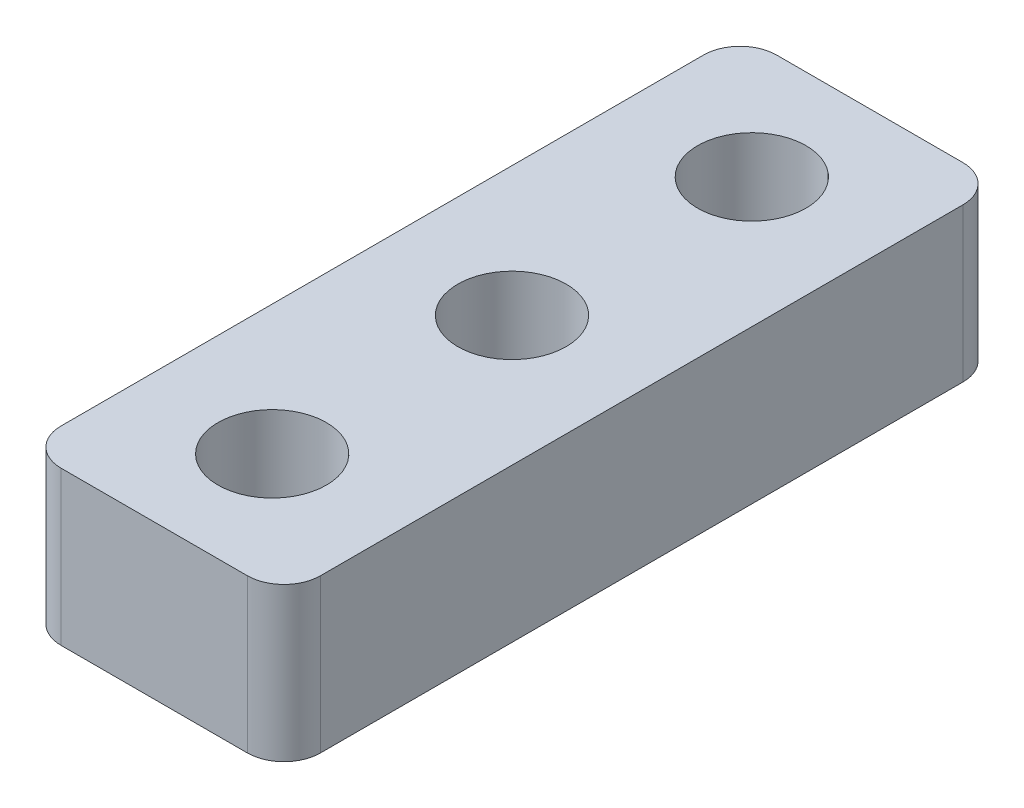
ISO-10303-21;
HEADER;
FILE_DESCRIPTION(('STEP AP214'),'2;1');
FILE_NAME('part.step','',(''),(''),'','','');
FILE_SCHEMA(('AUTOMOTIVE_DESIGN { 1 0 10303 214 1 1 1 1 }'));
ENDSEC;
DATA;
#1=APPLICATION_CONTEXT('core data for automotive mechanical design processes');
#2=APPLICATION_PROTOCOL_DEFINITION('international standard','automotive_design',2000,#1);
#3=PRODUCT_CONTEXT('',#1,'mechanical');
#4=PRODUCT('Part','Part','',(#3));
#5=PRODUCT_RELATED_PRODUCT_CATEGORY('part','',(#4));
#6=PRODUCT_DEFINITION_FORMATION('','',#4);
#7=PRODUCT_DEFINITION_CONTEXT('part definition',#1,'design');
#8=PRODUCT_DEFINITION('design','',#6,#7);
#9=PRODUCT_DEFINITION_SHAPE('','',#8);
#10=(LENGTH_UNIT() NAMED_UNIT(*) SI_UNIT(.MILLI.,.METRE.));
#11=(NAMED_UNIT(*) PLANE_ANGLE_UNIT() SI_UNIT($,.RADIAN.));
#12=(NAMED_UNIT(*) SI_UNIT($,.STERADIAN.) SOLID_ANGLE_UNIT());
#13=UNCERTAINTY_MEASURE_WITH_UNIT(LENGTH_MEASURE(1.E-05),#10,'distance_accuracy_value','');
#14=(GEOMETRIC_REPRESENTATION_CONTEXT(3) GLOBAL_UNCERTAINTY_ASSIGNED_CONTEXT((#13)) GLOBAL_UNIT_ASSIGNED_CONTEXT((#10,
#11,#12)) REPRESENTATION_CONTEXT('',''));
#15=CARTESIAN_POINT('',(0.,0.,0.));
#16=DIRECTION('',(0.,0.,1.));
#17=DIRECTION('',(1.,0.,0.));
#18=AXIS2_PLACEMENT_3D('',#15,#16,#17);
#19=CARTESIAN_POINT('',(0.,3.2004,7.459999939));
#20=DIRECTION('',(0.,-1.,0.));
#21=DIRECTION('',(1.,0.,0.));
#22=AXIS2_PLACEMENT_3D('',#19,#20,#21);
#23=PLANE('',#22);
#24=CARTESIAN_POINT('',(2.7045,3.2004,-4.9999999695));
#25=DIRECTION('',(0.,-1.,0.));
#26=DIRECTION('',(1.,0.,0.));
#27=AXIS2_PLACEMENT_3D('',#24,#25,#26);
#28=CIRCLE('',#27,1.1303);
#29=CARTESIAN_POINT('',(3.8348,3.2004,-4.9999999695));
#30=VERTEX_POINT('',#29);
#31=EDGE_CURVE('E245',#30,#30,#28,.F.);
#32=ORIENTED_EDGE('',*,*,#31,.F.);
#33=EDGE_LOOP('',(#32));
#34=FACE_BOUND('',#33,.T.);
#35=CARTESIAN_POINT('',(2.7045,3.2004,4.9999999695));
#36=DIRECTION('',(0.,-1.,0.));
#37=DIRECTION('',(1.,0.,0.));
#38=AXIS2_PLACEMENT_3D('',#35,#36,#37);
#39=CIRCLE('',#38,1.1303);
#40=CARTESIAN_POINT('',(3.8348,3.2004,4.9999999695));
#41=VERTEX_POINT('',#40);
#42=EDGE_CURVE('E240',#41,#41,#39,.F.);
#43=ORIENTED_EDGE('',*,*,#42,.F.);
#44=EDGE_LOOP('',(#43));
#45=FACE_BOUND('',#44,.T.);
#46=CARTESIAN_POINT('',(2.7045,3.2004,0.));
#47=DIRECTION('',(0.,-1.,0.));
#48=DIRECTION('',(1.,0.,0.));
#49=AXIS2_PLACEMENT_3D('',#46,#47,#48);
#50=CIRCLE('',#49,1.1303);
#51=CARTESIAN_POINT('',(3.8348,3.2004,0.));
#52=VERTEX_POINT('',#51);
#53=EDGE_CURVE('E158',#52,#52,#50,.F.);
#54=ORIENTED_EDGE('',*,*,#53,.F.);
#55=EDGE_LOOP('',(#54));
#56=FACE_BOUND('',#55,.T.);
#57=DIRECTION('',(-1.,0.,0.));
#58=VECTOR('',#57,1.);
#59=CARTESIAN_POINT('',(0.,3.2004,-7.459999939));
#60=LINE('',#59,#58);
#61=CARTESIAN_POINT('',(4.647,3.2004,-7.459999939));
#62=VERTEX_POINT('',#61);
#63=CARTESIAN_POINT('',(0.761999999999999,3.2004,-7.459999939));
#64=VERTEX_POINT('',#63);
#65=EDGE_CURVE('E155',#62,#64,#60,.T.);
#66=ORIENTED_EDGE('',*,*,#65,.T.);
#67=CARTESIAN_POINT('',(0.761999999999999,3.2004,-6.697999939));
#68=DIRECTION('',(0.,-1.,0.));
#69=DIRECTION('',(1.,0.,0.));
#70=AXIS2_PLACEMENT_3D('',#67,#68,#69);
#71=CIRCLE('',#70,0.762);
#72=CARTESIAN_POINT('',(0.,3.2004,-6.697999939));
#73=VERTEX_POINT('',#72);
#74=EDGE_CURVE('E140',#64,#73,#71,.F.);
#75=ORIENTED_EDGE('',*,*,#74,.T.);
#76=DIRECTION('',(0.,0.,-1.));
#77=VECTOR('',#76,1.);
#78=CARTESIAN_POINT('',(0.,3.2004,7.459999939));
#79=LINE('',#78,#77);
#80=CARTESIAN_POINT('',(0.,3.2004,6.697999939));
#81=VERTEX_POINT('',#80);
#82=EDGE_CURVE('E119',#81,#73,#79,.T.);
#83=ORIENTED_EDGE('',*,*,#82,.F.);
#84=CARTESIAN_POINT('',(0.761999999999999,3.2004,6.697999939));
#85=DIRECTION('',(0.,-1.,0.));
#86=DIRECTION('',(1.,0.,0.));
#87=AXIS2_PLACEMENT_3D('',#84,#85,#86);
#88=CIRCLE('',#87,0.762);
#89=CARTESIAN_POINT('',(0.761999999999999,3.2004,7.459999939));
#90=VERTEX_POINT('',#89);
#91=EDGE_CURVE('E123',#81,#90,#88,.F.);
#92=ORIENTED_EDGE('',*,*,#91,.T.);
#93=DIRECTION('',(-1.,0.,0.));
#94=VECTOR('',#93,1.);
#95=CARTESIAN_POINT('',(0.,3.2004,7.459999939));
#96=LINE('',#95,#94);
#97=CARTESIAN_POINT('',(4.647,3.2004,7.459999939));
#98=VERTEX_POINT('',#97);
#99=EDGE_CURVE('E149',#98,#90,#96,.T.);
#100=ORIENTED_EDGE('',*,*,#99,.F.);
#101=CARTESIAN_POINT('',(4.647,3.2004,6.697999939));
#102=DIRECTION('',(0.,-1.,0.));
#103=DIRECTION('',(1.,0.,0.));
#104=AXIS2_PLACEMENT_3D('',#101,#102,#103);
#105=CIRCLE('',#104,0.762);
#106=CARTESIAN_POINT('',(5.409,3.2004,6.697999939));
#107=VERTEX_POINT('',#106);
#108=EDGE_CURVE('E55',#98,#107,#105,.F.);
#109=ORIENTED_EDGE('',*,*,#108,.T.);
#110=DIRECTION('',(0.,0.,-1.));
#111=VECTOR('',#110,1.);
#112=CARTESIAN_POINT('',(5.409,3.2004,7.459999939));
#113=LINE('',#112,#111);
#114=CARTESIAN_POINT('',(5.409,3.2004,-6.697999939));
#115=VERTEX_POINT('',#114);
#116=EDGE_CURVE('E152',#107,#115,#113,.T.);
#117=ORIENTED_EDGE('',*,*,#116,.T.);
#118=CARTESIAN_POINT('',(4.647,3.2004,-6.697999939));
#119=DIRECTION('',(0.,-1.,0.));
#120=DIRECTION('',(1.,0.,0.));
#121=AXIS2_PLACEMENT_3D('',#118,#119,#120);
#122=CIRCLE('',#121,0.762);
#123=EDGE_CURVE('E47',#115,#62,#122,.F.);
#124=ORIENTED_EDGE('',*,*,#123,.T.);
#125=EDGE_LOOP('',(#66,#75,#83,#92,#100,#109,#117,#124));
#126=FACE_BOUND('',#125,.T.);
#127=ADVANCED_FACE('F32',(#34,#45,#56,#126),#23,.F.);
#128=CARTESIAN_POINT('',(0.,0.,7.459999939));
#129=DIRECTION('',(1.,0.,0.));
#130=DIRECTION('',(0.,1.,0.));
#131=AXIS2_PLACEMENT_3D('',#128,#129,#130);
#132=PLANE('',#131);
#133=ORIENTED_EDGE('',*,*,#82,.T.);
#134=DIRECTION('',(0.,-1.,0.));
#135=VECTOR('',#134,1.);
#136=CARTESIAN_POINT('',(0.,0.,-6.697999939));
#137=LINE('',#136,#135);
#138=CARTESIAN_POINT('',(0.,0.,-6.697999939));
#139=VERTEX_POINT('',#138);
#140=EDGE_CURVE('E110',#73,#139,#137,.T.);
#141=ORIENTED_EDGE('',*,*,#140,.T.);
#142=DIRECTION('',(0.,0.,-1.));
#143=VECTOR('',#142,1.);
#144=CARTESIAN_POINT('',(0.,0.,7.459999939));
#145=LINE('',#144,#143);
#146=CARTESIAN_POINT('',(0.,0.,6.697999939));
#147=VERTEX_POINT('',#146);
#148=EDGE_CURVE('E102',#147,#139,#145,.T.);
#149=ORIENTED_EDGE('',*,*,#148,.F.);
#150=DIRECTION('',(0.,-1.,0.));
#151=VECTOR('',#150,1.);
#152=CARTESIAN_POINT('',(0.,0.,6.697999939));
#153=LINE('',#152,#151);
#154=EDGE_CURVE('E116',#147,#81,#153,.F.);
#155=ORIENTED_EDGE('',*,*,#154,.T.);
#156=EDGE_LOOP('',(#133,#141,#149,#155));
#157=FACE_BOUND('',#156,.T.);
#158=ADVANCED_FACE('F115',(#157),#132,.F.);
#159=CARTESIAN_POINT('',(0.,0.,7.459999939));
#160=DIRECTION('',(0.,1.,0.));
#161=DIRECTION('',(-1.,0.,0.));
#162=AXIS2_PLACEMENT_3D('',#159,#160,#161);
#163=PLANE('',#162);
#164=CARTESIAN_POINT('',(2.7045,0.,-4.9999999695));
#165=DIRECTION('',(0.,-1.,0.));
#166=DIRECTION('',(1.,0.,0.));
#167=AXIS2_PLACEMENT_3D('',#164,#165,#166);
#168=CIRCLE('',#167,1.1303);
#169=CARTESIAN_POINT('',(3.8348,0.,-4.9999999695));
#170=VERTEX_POINT('',#169);
#171=EDGE_CURVE('E231',#170,#170,#168,.T.);
#172=ORIENTED_EDGE('',*,*,#171,.F.);
#173=EDGE_LOOP('',(#172));
#174=FACE_BOUND('',#173,.T.);
#175=CARTESIAN_POINT('',(2.7045,0.,4.9999999695));
#176=DIRECTION('',(0.,-1.,0.));
#177=DIRECTION('',(1.,0.,0.));
#178=AXIS2_PLACEMENT_3D('',#175,#176,#177);
#179=CIRCLE('',#178,1.1303);
#180=CARTESIAN_POINT('',(3.8348,0.,4.9999999695));
#181=VERTEX_POINT('',#180);
#182=EDGE_CURVE('E235',#181,#181,#179,.T.);
#183=ORIENTED_EDGE('',*,*,#182,.F.);
#184=EDGE_LOOP('',(#183));
#185=FACE_BOUND('',#184,.T.);
#186=CARTESIAN_POINT('',(2.7045,0.,0.));
#187=DIRECTION('',(0.,-1.,0.));
#188=DIRECTION('',(1.,0.,0.));
#189=AXIS2_PLACEMENT_3D('',#186,#187,#188);
#190=CIRCLE('',#189,1.1303);
#191=CARTESIAN_POINT('',(3.8348,0.,0.));
#192=VERTEX_POINT('',#191);
#193=EDGE_CURVE('E238',#192,#192,#190,.T.);
#194=ORIENTED_EDGE('',*,*,#193,.F.);
#195=EDGE_LOOP('',(#194));
#196=FACE_BOUND('',#195,.T.);
#197=ORIENTED_EDGE('',*,*,#148,.T.);
#198=CARTESIAN_POINT('',(0.762,0.,-6.697999939));
#199=DIRECTION('',(0.,1.,0.));
#200=DIRECTION('',(-1.,0.,0.));
#201=AXIS2_PLACEMENT_3D('',#198,#199,#200);
#202=CIRCLE('',#201,0.762);
#203=CARTESIAN_POINT('',(0.762,0.,-7.459999939));
#204=VERTEX_POINT('',#203);
#205=EDGE_CURVE('E131',#139,#204,#202,.F.);
#206=ORIENTED_EDGE('',*,*,#205,.T.);
#207=DIRECTION('',(1.,0.,0.));
#208=VECTOR('',#207,1.);
#209=CARTESIAN_POINT('',(0.,0.,-7.459999939));
#210=LINE('',#209,#208);
#211=CARTESIAN_POINT('',(4.647,0.,-7.459999939));
#212=VERTEX_POINT('',#211);
#213=EDGE_CURVE('E150',#204,#212,#210,.T.);
#214=ORIENTED_EDGE('',*,*,#213,.T.);
#215=CARTESIAN_POINT('',(4.647,0.,-6.697999939));
#216=DIRECTION('',(0.,1.,0.));
#217=DIRECTION('',(-1.,0.,0.));
#218=AXIS2_PLACEMENT_3D('',#215,#216,#217);
#219=CIRCLE('',#218,0.762);
#220=CARTESIAN_POINT('',(5.409,0.,-6.697999939));
#221=VERTEX_POINT('',#220);
#222=EDGE_CURVE('E129',#212,#221,#219,.F.);
#223=ORIENTED_EDGE('',*,*,#222,.T.);
#224=DIRECTION('',(0.,0.,-1.));
#225=VECTOR('',#224,1.);
#226=CARTESIAN_POINT('',(5.409,0.,7.459999939));
#227=LINE('',#226,#225);
#228=CARTESIAN_POINT('',(5.409,0.,6.697999939));
#229=VERTEX_POINT('',#228);
#230=EDGE_CURVE('E120',#229,#221,#227,.T.);
#231=ORIENTED_EDGE('',*,*,#230,.F.);
#232=CARTESIAN_POINT('',(4.647,0.,6.697999939));
#233=DIRECTION('',(0.,1.,0.));
#234=DIRECTION('',(-1.,0.,0.));
#235=AXIS2_PLACEMENT_3D('',#232,#233,#234);
#236=CIRCLE('',#235,0.762);
#237=CARTESIAN_POINT('',(4.647,0.,7.459999939));
#238=VERTEX_POINT('',#237);
#239=EDGE_CURVE('E109',#229,#238,#236,.F.);
#240=ORIENTED_EDGE('',*,*,#239,.T.);
#241=DIRECTION('',(1.,0.,0.));
#242=VECTOR('',#241,1.);
#243=CARTESIAN_POINT('',(0.,0.,7.459999939));
#244=LINE('',#243,#242);
#245=CARTESIAN_POINT('',(0.762,0.,7.459999939));
#246=VERTEX_POINT('',#245);
#247=EDGE_CURVE('E104',#246,#238,#244,.T.);
#248=ORIENTED_EDGE('',*,*,#247,.F.);
#249=CARTESIAN_POINT('',(0.762,0.,6.697999939));
#250=DIRECTION('',(0.,1.,0.));
#251=DIRECTION('',(-1.,0.,0.));
#252=AXIS2_PLACEMENT_3D('',#249,#250,#251);
#253=CIRCLE('',#252,0.762);
#254=EDGE_CURVE('E99',#246,#147,#253,.F.);
#255=ORIENTED_EDGE('',*,*,#254,.T.);
#256=EDGE_LOOP('',(#197,#206,#214,#223,#231,#240,#248,#255));
#257=FACE_BOUND('',#256,.T.);
#258=ADVANCED_FACE('F101',(#174,#185,#196,#257),#163,.F.);
#259=CARTESIAN_POINT('',(5.409,3.2004,7.459999939));
#260=DIRECTION('',(-1.,0.,0.));
#261=DIRECTION('',(0.,-1.,0.));
#262=AXIS2_PLACEMENT_3D('',#259,#260,#261);
#263=PLANE('',#262);
#264=ORIENTED_EDGE('',*,*,#230,.T.);
#265=DIRECTION('',(0.,1.,0.));
#266=VECTOR('',#265,1.);
#267=CARTESIAN_POINT('',(5.409,3.2004,-6.697999939));
#268=LINE('',#267,#266);
#269=EDGE_CURVE('E144',#221,#115,#268,.T.);
#270=ORIENTED_EDGE('',*,*,#269,.T.);
#271=ORIENTED_EDGE('',*,*,#116,.F.);
#272=DIRECTION('',(0.,1.,0.));
#273=VECTOR('',#272,1.);
#274=CARTESIAN_POINT('',(5.409,3.2004,6.697999939));
#275=LINE('',#274,#273);
#276=EDGE_CURVE('E142',#107,#229,#275,.F.);
#277=ORIENTED_EDGE('',*,*,#276,.T.);
#278=EDGE_LOOP('',(#264,#270,#271,#277));
#279=FACE_BOUND('',#278,.T.);
#280=ADVANCED_FACE('F167',(#279),#263,.F.);
#281=CARTESIAN_POINT('',(0.,0.,7.459999939));
#282=DIRECTION('',(0.,0.,-1.));
#283=DIRECTION('',(-1.,0.,0.));
#284=AXIS2_PLACEMENT_3D('',#281,#282,#283);
#285=PLANE('',#284);
#286=ORIENTED_EDGE('',*,*,#247,.T.);
#287=DIRECTION('',(0.,1.,0.));
#288=VECTOR('',#287,1.);
#289=CARTESIAN_POINT('',(4.647,0.,7.459999939));
#290=LINE('',#289,#288);
#291=EDGE_CURVE('E11',#238,#98,#290,.T.);
#292=ORIENTED_EDGE('',*,*,#291,.T.);
#293=ORIENTED_EDGE('',*,*,#99,.T.);
#294=DIRECTION('',(0.,-1.,0.));
#295=VECTOR('',#294,1.);
#296=CARTESIAN_POINT('',(0.762,0.,7.459999939));
#297=LINE('',#296,#295);
#298=EDGE_CURVE('E40',#90,#246,#297,.T.);
#299=ORIENTED_EDGE('',*,*,#298,.T.);
#300=EDGE_LOOP('',(#286,#292,#293,#299));
#301=FACE_BOUND('',#300,.T.);
#302=ADVANCED_FACE('F147',(#301),#285,.F.);
#303=CARTESIAN_POINT('',(0.,0.,-7.459999939));
#304=DIRECTION('',(0.,0.,-1.));
#305=DIRECTION('',(-1.,0.,0.));
#306=AXIS2_PLACEMENT_3D('',#303,#304,#305);
#307=PLANE('',#306);
#308=ORIENTED_EDGE('',*,*,#213,.F.);
#309=DIRECTION('',(0.,-1.,0.));
#310=VECTOR('',#309,1.);
#311=CARTESIAN_POINT('',(0.761999999999999,3.2004,-7.459999939));
#312=LINE('',#311,#310);
#313=EDGE_CURVE('E135',#204,#64,#312,.F.);
#314=ORIENTED_EDGE('',*,*,#313,.T.);
#315=ORIENTED_EDGE('',*,*,#65,.F.);
#316=DIRECTION('',(0.,1.,0.));
#317=VECTOR('',#316,1.);
#318=CARTESIAN_POINT('',(4.647,0.,-7.459999939));
#319=LINE('',#318,#317);
#320=EDGE_CURVE('E133',#62,#212,#319,.F.);
#321=ORIENTED_EDGE('',*,*,#320,.T.);
#322=EDGE_LOOP('',(#308,#314,#315,#321));
#323=FACE_BOUND('',#322,.T.);
#324=ADVANCED_FACE('F175',(#323),#307,.T.);
#325=CARTESIAN_POINT('',(2.7045,6.39737117910062,0.));
#326=DIRECTION('',(0.,-1.,0.));
#327=DIRECTION('',(1.,0.,0.));
#328=AXIS2_PLACEMENT_3D('',#325,#326,#327);
#329=CYLINDRICAL_SURFACE('',#328,1.1303);
#330=ORIENTED_EDGE('',*,*,#53,.T.);
#331=EDGE_LOOP('',(#330));
#332=FACE_BOUND('',#331,.T.);
#333=ORIENTED_EDGE('',*,*,#193,.T.);
#334=EDGE_LOOP('',(#333));
#335=FACE_BOUND('',#334,.T.);
#336=ADVANCED_FACE('F210',(#332,#335),#329,.F.);
#337=CARTESIAN_POINT('',(2.7045,6.39737117910062,4.9999999695));
#338=DIRECTION('',(0.,-1.,0.));
#339=DIRECTION('',(1.,0.,0.));
#340=AXIS2_PLACEMENT_3D('',#337,#338,#339);
#341=CYLINDRICAL_SURFACE('',#340,1.1303);
#342=ORIENTED_EDGE('',*,*,#42,.T.);
#343=EDGE_LOOP('',(#342));
#344=FACE_BOUND('',#343,.T.);
#345=ORIENTED_EDGE('',*,*,#182,.T.);
#346=EDGE_LOOP('',(#345));
#347=FACE_BOUND('',#346,.T.);
#348=ADVANCED_FACE('F204',(#344,#347),#341,.F.);
#349=CARTESIAN_POINT('',(2.7045,6.39737117910062,-4.9999999695));
#350=DIRECTION('',(0.,-1.,0.));
#351=DIRECTION('',(1.,0.,0.));
#352=AXIS2_PLACEMENT_3D('',#349,#350,#351);
#353=CYLINDRICAL_SURFACE('',#352,1.1303);
#354=ORIENTED_EDGE('',*,*,#31,.T.);
#355=EDGE_LOOP('',(#354));
#356=FACE_BOUND('',#355,.T.);
#357=ORIENTED_EDGE('',*,*,#171,.T.);
#358=EDGE_LOOP('',(#357));
#359=FACE_BOUND('',#358,.T.);
#360=ADVANCED_FACE('F200',(#356,#359),#353,.F.);
#361=CARTESIAN_POINT('',(0.762,0.,-6.697999939));
#362=DIRECTION('',(0.,1.,0.));
#363=DIRECTION('',(-1.,0.,0.));
#364=AXIS2_PLACEMENT_3D('',#361,#362,#363);
#365=CYLINDRICAL_SURFACE('',#364,0.762);
#366=ORIENTED_EDGE('',*,*,#74,.F.);
#367=ORIENTED_EDGE('',*,*,#313,.F.);
#368=ORIENTED_EDGE('',*,*,#205,.F.);
#369=ORIENTED_EDGE('',*,*,#140,.F.);
#370=EDGE_LOOP('',(#366,#367,#368,#369));
#371=FACE_BOUND('',#370,.T.);
#372=ADVANCED_FACE('F179',(#371),#365,.T.);
#373=CARTESIAN_POINT('',(4.647,3.2004,-6.697999939));
#374=DIRECTION('',(0.,-1.,0.));
#375=DIRECTION('',(1.,0.,0.));
#376=AXIS2_PLACEMENT_3D('',#373,#374,#375);
#377=CYLINDRICAL_SURFACE('',#376,0.762);
#378=ORIENTED_EDGE('',*,*,#222,.F.);
#379=ORIENTED_EDGE('',*,*,#320,.F.);
#380=ORIENTED_EDGE('',*,*,#123,.F.);
#381=ORIENTED_EDGE('',*,*,#269,.F.);
#382=EDGE_LOOP('',(#378,#379,#380,#381));
#383=FACE_BOUND('',#382,.T.);
#384=ADVANCED_FACE('F171',(#383),#377,.T.);
#385=CARTESIAN_POINT('',(4.647,0.,6.697999939));
#386=DIRECTION('',(0.,1.,0.));
#387=DIRECTION('',(-1.,0.,0.));
#388=AXIS2_PLACEMENT_3D('',#385,#386,#387);
#389=CYLINDRICAL_SURFACE('',#388,0.762);
#390=ORIENTED_EDGE('',*,*,#239,.F.);
#391=ORIENTED_EDGE('',*,*,#276,.F.);
#392=ORIENTED_EDGE('',*,*,#108,.F.);
#393=ORIENTED_EDGE('',*,*,#291,.F.);
#394=EDGE_LOOP('',(#390,#391,#392,#393));
#395=FACE_BOUND('',#394,.T.);
#396=ADVANCED_FACE('F181',(#395),#389,.T.);
#397=CARTESIAN_POINT('',(0.762,0.,6.697999939));
#398=DIRECTION('',(0.,-1.,0.));
#399=DIRECTION('',(1.,0.,0.));
#400=AXIS2_PLACEMENT_3D('',#397,#398,#399);
#401=CYLINDRICAL_SURFACE('',#400,0.762);
#402=ORIENTED_EDGE('',*,*,#91,.F.);
#403=ORIENTED_EDGE('',*,*,#154,.F.);
#404=ORIENTED_EDGE('',*,*,#254,.F.);
#405=ORIENTED_EDGE('',*,*,#298,.F.);
#406=EDGE_LOOP('',(#402,#403,#404,#405));
#407=FACE_BOUND('',#406,.T.);
#408=ADVANCED_FACE('F34',(#407),#401,.T.);
#409=CLOSED_SHELL('',(#127,#158,#258,#280,#302,#324,#336,#348,#360,#372,#384,#396,#408));
#410=MANIFOLD_SOLID_BREP('B2',#409);
#411=ADVANCED_BREP_SHAPE_REPRESENTATION('',(#18,#410),#14);
#412=SHAPE_DEFINITION_REPRESENTATION(#9,#411);
ENDSEC;
END-ISO-10303-21;
